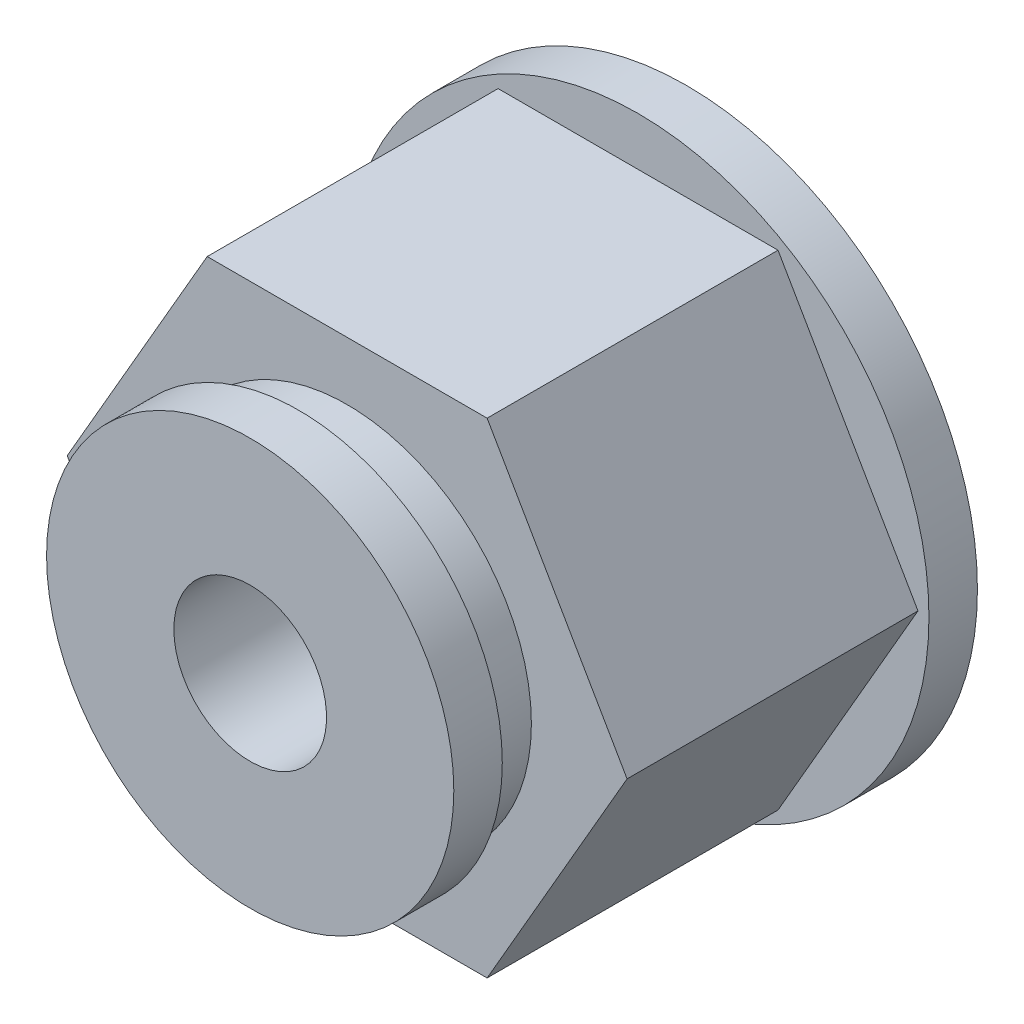
ISO-10303-21;
HEADER;
FILE_DESCRIPTION(('STEP AP214'),'2;1');
FILE_NAME('part.step','',(''),(''),'','','');
FILE_SCHEMA(('AUTOMOTIVE_DESIGN { 1 0 10303 214 1 1 1 1 }'));
ENDSEC;
DATA;
#1=APPLICATION_CONTEXT('core data for automotive mechanical design processes');
#2=APPLICATION_PROTOCOL_DEFINITION('international standard','automotive_design',2000,#1);
#3=PRODUCT_CONTEXT('',#1,'mechanical');
#4=PRODUCT('Part','Part','',(#3));
#5=PRODUCT_RELATED_PRODUCT_CATEGORY('part','',(#4));
#6=PRODUCT_DEFINITION_FORMATION('','',#4);
#7=PRODUCT_DEFINITION_CONTEXT('part definition',#1,'design');
#8=PRODUCT_DEFINITION('design','',#6,#7);
#9=PRODUCT_DEFINITION_SHAPE('','',#8);
#10=(LENGTH_UNIT() NAMED_UNIT(*) SI_UNIT(.MILLI.,.METRE.));
#11=(NAMED_UNIT(*) PLANE_ANGLE_UNIT() SI_UNIT($,.RADIAN.));
#12=(NAMED_UNIT(*) SI_UNIT($,.STERADIAN.) SOLID_ANGLE_UNIT());
#13=UNCERTAINTY_MEASURE_WITH_UNIT(LENGTH_MEASURE(1.E-05),#10,'distance_accuracy_value','');
#14=(GEOMETRIC_REPRESENTATION_CONTEXT(3) GLOBAL_UNCERTAINTY_ASSIGNED_CONTEXT((#13)) GLOBAL_UNIT_ASSIGNED_CONTEXT((#10,
#11,#12)) REPRESENTATION_CONTEXT('',''));
#15=CARTESIAN_POINT('',(0.,0.,0.));
#16=DIRECTION('',(0.,0.,1.));
#17=DIRECTION('',(1.,0.,0.));
#18=AXIS2_PLACEMENT_3D('',#15,#16,#17);
#19=CARTESIAN_POINT('',(3.6661742093542,-6.34999999999996,3.81));
#20=DIRECTION('',(-0.866025403784442,0.499999999999995,0.));
#21=DIRECTION('',(-0.499999999999995,-0.866025403784442,0.));
#22=AXIS2_PLACEMENT_3D('',#19,#20,#21);
#23=PLANE('',#22);
#24=DIRECTION('',(0.499999999999995,0.866025403784441,0.));
#25=VECTOR('',#24,1.);
#26=CARTESIAN_POINT('',(3.6661742093542,-6.34999999999996,-3.81));
#27=LINE('',#26,#25);
#28=CARTESIAN_POINT('',(3.6661742093542,-6.34999999999996,-3.81));
#29=VERTEX_POINT('',#28);
#30=CARTESIAN_POINT('',(7.33234841870825,0.,-3.81));
#31=VERTEX_POINT('',#30);
#32=EDGE_CURVE('E86',#29,#31,#27,.T.);
#33=ORIENTED_EDGE('',*,*,#32,.T.);
#34=DIRECTION('',(0.,0.,-1.));
#35=VECTOR('',#34,1.);
#36=CARTESIAN_POINT('',(7.33234841870825,0.,3.81));
#37=LINE('',#36,#35);
#38=CARTESIAN_POINT('',(7.33234841870825,0.,3.81));
#39=VERTEX_POINT('',#38);
#40=EDGE_CURVE('E11',#39,#31,#37,.T.);
#41=ORIENTED_EDGE('',*,*,#40,.F.);
#42=DIRECTION('',(0.499999999999995,0.866025403784441,0.));
#43=VECTOR('',#42,1.);
#44=CARTESIAN_POINT('',(3.6661742093542,-6.34999999999996,3.81));
#45=LINE('',#44,#43);
#46=CARTESIAN_POINT('',(3.6661742093542,-6.34999999999996,3.81));
#47=VERTEX_POINT('',#46);
#48=EDGE_CURVE('E90',#47,#39,#45,.T.);
#49=ORIENTED_EDGE('',*,*,#48,.F.);
#50=DIRECTION('',(0.,0.,-1.));
#51=VECTOR('',#50,1.);
#52=CARTESIAN_POINT('',(3.6661742093542,-6.34999999999996,3.81));
#53=LINE('',#52,#51);
#54=EDGE_CURVE('E103',#47,#29,#53,.T.);
#55=ORIENTED_EDGE('',*,*,#54,.T.);
#56=EDGE_LOOP('',(#33,#41,#49,#55));
#57=FACE_BOUND('',#56,.T.);
#58=ADVANCED_FACE('F32',(#57),#23,.F.);
#59=CARTESIAN_POINT('',(7.33234841870825,0.,3.81));
#60=DIRECTION('',(-0.866025403784438,-0.500000000000001,0.));
#61=DIRECTION('',(0.500000000000001,-0.866025403784438,0.));
#62=AXIS2_PLACEMENT_3D('',#59,#60,#61);
#63=PLANE('',#62);
#64=DIRECTION('',(-0.500000000000001,0.866025403784438,0.));
#65=VECTOR('',#64,1.);
#66=CARTESIAN_POINT('',(7.33234841870825,0.,-3.81));
#67=LINE('',#66,#65);
#68=CARTESIAN_POINT('',(3.66617420935411,6.35000000000001,-3.81));
#69=VERTEX_POINT('',#68);
#70=EDGE_CURVE('E123',#31,#69,#67,.T.);
#71=ORIENTED_EDGE('',*,*,#70,.T.);
#72=DIRECTION('',(0.,0.,-1.));
#73=VECTOR('',#72,1.);
#74=CARTESIAN_POINT('',(3.66617420935411,6.35000000000001,3.81));
#75=LINE('',#74,#73);
#76=CARTESIAN_POINT('',(3.66617420935411,6.35000000000001,3.81));
#77=VERTEX_POINT('',#76);
#78=EDGE_CURVE('E40',#77,#69,#75,.T.);
#79=ORIENTED_EDGE('',*,*,#78,.F.);
#80=DIRECTION('',(-0.500000000000001,0.866025403784438,0.));
#81=VECTOR('',#80,1.);
#82=CARTESIAN_POINT('',(7.33234841870825,0.,3.81));
#83=LINE('',#82,#81);
#84=EDGE_CURVE('E122',#39,#77,#83,.T.);
#85=ORIENTED_EDGE('',*,*,#84,.F.);
#86=ORIENTED_EDGE('',*,*,#40,.T.);
#87=EDGE_LOOP('',(#71,#79,#85,#86));
#88=FACE_BOUND('',#87,.T.);
#89=ADVANCED_FACE('F121',(#88),#63,.F.);
#90=CARTESIAN_POINT('',(3.66617420935411,6.35000000000001,3.81));
#91=DIRECTION('',(0.,-1.,0.));
#92=DIRECTION('',(1.,0.,0.));
#93=AXIS2_PLACEMENT_3D('',#90,#91,#92);
#94=PLANE('',#93);
#95=DIRECTION('',(-1.,0.,0.));
#96=VECTOR('',#95,1.);
#97=CARTESIAN_POINT('',(3.66617420935411,6.35000000000001,-3.81));
#98=LINE('',#97,#96);
#99=CARTESIAN_POINT('',(-3.66617420935416,6.34999999999999,-3.81));
#100=VERTEX_POINT('',#99);
#101=EDGE_CURVE('E117',#69,#100,#98,.T.);
#102=ORIENTED_EDGE('',*,*,#101,.T.);
#103=DIRECTION('',(0.,0.,-1.));
#104=VECTOR('',#103,1.);
#105=CARTESIAN_POINT('',(-3.66617420935416,6.34999999999999,3.81));
#106=LINE('',#105,#104);
#107=CARTESIAN_POINT('',(-3.66617420935416,6.34999999999999,3.81));
#108=VERTEX_POINT('',#107);
#109=EDGE_CURVE('E105',#108,#100,#106,.T.);
#110=ORIENTED_EDGE('',*,*,#109,.F.);
#111=DIRECTION('',(-1.,0.,0.));
#112=VECTOR('',#111,1.);
#113=CARTESIAN_POINT('',(3.66617420935411,6.35000000000001,3.81));
#114=LINE('',#113,#112);
#115=EDGE_CURVE('E118',#77,#108,#114,.T.);
#116=ORIENTED_EDGE('',*,*,#115,.F.);
#117=ORIENTED_EDGE('',*,*,#78,.T.);
#118=EDGE_LOOP('',(#102,#110,#116,#117));
#119=FACE_BOUND('',#118,.T.);
#120=ADVANCED_FACE('F115',(#119),#94,.F.);
#121=CARTESIAN_POINT('',(-3.66617420935416,6.34999999999999,3.81));
#122=DIRECTION('',(0.866025403784442,-0.499999999999995,0.));
#123=DIRECTION('',(0.499999999999995,0.866025403784442,0.));
#124=AXIS2_PLACEMENT_3D('',#121,#122,#123);
#125=PLANE('',#124);
#126=DIRECTION('',(-0.499999999999995,-0.866025403784441,0.));
#127=VECTOR('',#126,1.);
#128=CARTESIAN_POINT('',(-3.66617420935416,6.34999999999999,-3.81));
#129=LINE('',#128,#127);
#130=CARTESIAN_POINT('',(-7.33234841870825,0.,-3.81));
#131=VERTEX_POINT('',#130);
#132=EDGE_CURVE('E100',#100,#131,#129,.T.);
#133=ORIENTED_EDGE('',*,*,#132,.T.);
#134=DIRECTION('',(0.,0.,-1.));
#135=VECTOR('',#134,1.);
#136=CARTESIAN_POINT('',(-7.33234841870825,0.,3.81));
#137=LINE('',#136,#135);
#138=CARTESIAN_POINT('',(-7.33234841870825,0.,3.81));
#139=VERTEX_POINT('',#138);
#140=EDGE_CURVE('E99',#139,#131,#137,.T.);
#141=ORIENTED_EDGE('',*,*,#140,.F.);
#142=DIRECTION('',(-0.499999999999995,-0.866025403784441,0.));
#143=VECTOR('',#142,1.);
#144=CARTESIAN_POINT('',(-3.66617420935416,6.34999999999999,3.81));
#145=LINE('',#144,#143);
#146=EDGE_CURVE('E134',#108,#139,#145,.T.);
#147=ORIENTED_EDGE('',*,*,#146,.F.);
#148=ORIENTED_EDGE('',*,*,#109,.T.);
#149=EDGE_LOOP('',(#133,#141,#147,#148));
#150=FACE_BOUND('',#149,.T.);
#151=ADVANCED_FACE('F132',(#150),#125,.F.);
#152=CARTESIAN_POINT('',(-7.33234841870825,0.,3.81));
#153=DIRECTION('',(0.866025403784434,0.500000000000007,0.));
#154=DIRECTION('',(-0.500000000000007,0.866025403784435,0.));
#155=AXIS2_PLACEMENT_3D('',#152,#153,#154);
#156=PLANE('',#155);
#157=DIRECTION('',(0.500000000000007,-0.866025403784435,0.));
#158=VECTOR('',#157,1.);
#159=CARTESIAN_POINT('',(-7.33234841870825,0.,-3.81));
#160=LINE('',#159,#158);
#161=CARTESIAN_POINT('',(-3.66617420935407,-6.35000000000004,-3.81));
#162=VERTEX_POINT('',#161);
#163=EDGE_CURVE('E83',#131,#162,#160,.T.);
#164=ORIENTED_EDGE('',*,*,#163,.T.);
#165=DIRECTION('',(0.,0.,-1.));
#166=VECTOR('',#165,1.);
#167=CARTESIAN_POINT('',(-3.66617420935407,-6.35000000000004,3.81));
#168=LINE('',#167,#166);
#169=CARTESIAN_POINT('',(-3.66617420935407,-6.35000000000004,3.81));
#170=VERTEX_POINT('',#169);
#171=EDGE_CURVE('E97',#170,#162,#168,.T.);
#172=ORIENTED_EDGE('',*,*,#171,.F.);
#173=DIRECTION('',(0.500000000000007,-0.866025403784435,0.));
#174=VECTOR('',#173,1.);
#175=CARTESIAN_POINT('',(-7.33234841870825,0.,3.81));
#176=LINE('',#175,#174);
#177=EDGE_CURVE('E135',#139,#170,#176,.T.);
#178=ORIENTED_EDGE('',*,*,#177,.F.);
#179=ORIENTED_EDGE('',*,*,#140,.T.);
#180=EDGE_LOOP('',(#164,#172,#178,#179));
#181=FACE_BOUND('',#180,.T.);
#182=ADVANCED_FACE('F95',(#181),#156,.F.);
#183=CARTESIAN_POINT('',(-3.66617420935407,-6.35000000000004,3.81));
#184=DIRECTION('',(0.,1.,0.));
#185=DIRECTION('',(-1.,0.,0.));
#186=AXIS2_PLACEMENT_3D('',#183,#184,#185);
#187=PLANE('',#186);
#188=DIRECTION('',(1.,0.,0.));
#189=VECTOR('',#188,1.);
#190=CARTESIAN_POINT('',(-3.66617420935407,-6.35000000000004,-3.81));
#191=LINE('',#190,#189);
#192=EDGE_CURVE('E80',#162,#29,#191,.T.);
#193=ORIENTED_EDGE('',*,*,#192,.T.);
#194=ORIENTED_EDGE('',*,*,#54,.F.);
#195=DIRECTION('',(1.,0.,0.));
#196=VECTOR('',#195,1.);
#197=CARTESIAN_POINT('',(-3.66617420935407,-6.35000000000004,3.81));
#198=LINE('',#197,#196);
#199=EDGE_CURVE('E47',#170,#47,#198,.T.);
#200=ORIENTED_EDGE('',*,*,#199,.F.);
#201=ORIENTED_EDGE('',*,*,#171,.T.);
#202=EDGE_LOOP('',(#193,#194,#200,#201));
#203=FACE_BOUND('',#202,.T.);
#204=ADVANCED_FACE('F102',(#203),#187,.F.);
#205=CARTESIAN_POINT('',(0.,0.,3.81));
#206=DIRECTION('',(0.,0.,1.));
#207=DIRECTION('',(1.,0.,0.));
#208=AXIS2_PLACEMENT_3D('',#205,#206,#207);
#209=PLANE('',#208);
#210=CARTESIAN_POINT('',(0.,0.,3.81));
#211=DIRECTION('',(0.,0.,1.));
#212=DIRECTION('',(1.,0.,0.));
#213=AXIS2_PLACEMENT_3D('',#210,#211,#212);
#214=CIRCLE('',#213,4.826);
#215=CARTESIAN_POINT('',(4.826,0.,3.81));
#216=VERTEX_POINT('',#215);
#217=EDGE_CURVE('E148',#216,#216,#214,.T.);
#218=ORIENTED_EDGE('',*,*,#217,.F.);
#219=EDGE_LOOP('',(#218));
#220=FACE_BOUND('',#219,.T.);
#221=ORIENTED_EDGE('',*,*,#48,.T.);
#222=ORIENTED_EDGE('',*,*,#84,.T.);
#223=ORIENTED_EDGE('',*,*,#115,.T.);
#224=ORIENTED_EDGE('',*,*,#146,.T.);
#225=ORIENTED_EDGE('',*,*,#177,.T.);
#226=ORIENTED_EDGE('',*,*,#199,.T.);
#227=EDGE_LOOP('',(#221,#222,#223,#224,#225,#226));
#228=FACE_BOUND('',#227,.T.);
#229=ADVANCED_FACE('F190',(#220,#228),#209,.T.);
#230=CARTESIAN_POINT('',(0.,0.,-3.81));
#231=DIRECTION('',(0.,0.,-1.));
#232=DIRECTION('',(-1.,0.,0.));
#233=AXIS2_PLACEMENT_3D('',#230,#231,#232);
#234=PLANE('',#233);
#235=CARTESIAN_POINT('',(0.,0.,-3.81));
#236=DIRECTION('',(0.,0.,-1.));
#237=DIRECTION('',(-1.,0.,0.));
#238=AXIS2_PLACEMENT_3D('',#235,#236,#237);
#239=CIRCLE('',#238,7.62);
#240=CARTESIAN_POINT('',(-7.62,0.,-3.81));
#241=VERTEX_POINT('',#240);
#242=EDGE_CURVE('E142',#241,#241,#239,.T.);
#243=ORIENTED_EDGE('',*,*,#242,.F.);
#244=EDGE_LOOP('',(#243));
#245=FACE_BOUND('',#244,.T.);
#246=ORIENTED_EDGE('',*,*,#70,.F.);
#247=ORIENTED_EDGE('',*,*,#32,.F.);
#248=ORIENTED_EDGE('',*,*,#192,.F.);
#249=ORIENTED_EDGE('',*,*,#163,.F.);
#250=ORIENTED_EDGE('',*,*,#132,.F.);
#251=ORIENTED_EDGE('',*,*,#101,.F.);
#252=EDGE_LOOP('',(#246,#247,#248,#249,#250,#251));
#253=FACE_BOUND('',#252,.T.);
#254=ADVANCED_FACE('F82',(#245,#253),#234,.F.);
#255=CARTESIAN_POINT('',(0.,0.,-5.08));
#256=DIRECTION('',(0.,0.,1.));
#257=DIRECTION('',(1.,0.,0.));
#258=AXIS2_PLACEMENT_3D('',#255,#256,#257);
#259=CYLINDRICAL_SURFACE('',#258,7.62);
#260=CARTESIAN_POINT('',(0.,0.,-5.08));
#261=DIRECTION('',(0.,0.,-1.));
#262=DIRECTION('',(-1.,0.,0.));
#263=AXIS2_PLACEMENT_3D('',#260,#261,#262);
#264=CIRCLE('',#263,7.62);
#265=CARTESIAN_POINT('',(-7.62,0.,-5.08));
#266=VERTEX_POINT('',#265);
#267=EDGE_CURVE('E127',#266,#266,#264,.T.);
#268=ORIENTED_EDGE('',*,*,#267,.F.);
#269=EDGE_LOOP('',(#268));
#270=FACE_BOUND('',#269,.T.);
#271=ORIENTED_EDGE('',*,*,#242,.T.);
#272=EDGE_LOOP('',(#271));
#273=FACE_BOUND('',#272,.T.);
#274=ADVANCED_FACE('F180',(#270,#273),#259,.T.);
#275=CARTESIAN_POINT('',(0.,0.,-5.08));
#276=DIRECTION('',(0.,0.,-1.));
#277=DIRECTION('',(-1.,0.,0.));
#278=AXIS2_PLACEMENT_3D('',#275,#276,#277);
#279=PLANE('',#278);
#280=CARTESIAN_POINT('',(0.,0.,-5.08));
#281=DIRECTION('',(0.,0.,-1.));
#282=DIRECTION('',(-1.,0.,0.));
#283=AXIS2_PLACEMENT_3D('',#280,#281,#282);
#284=CIRCLE('',#283,2.);
#285=CARTESIAN_POINT('',(-2.,0.,-5.08));
#286=VERTEX_POINT('',#285);
#287=EDGE_CURVE('E160',#286,#286,#284,.T.);
#288=ORIENTED_EDGE('',*,*,#287,.F.);
#289=EDGE_LOOP('',(#288));
#290=FACE_BOUND('',#289,.T.);
#291=ORIENTED_EDGE('',*,*,#267,.T.);
#292=EDGE_LOOP('',(#291));
#293=FACE_BOUND('',#292,.T.);
#294=ADVANCED_FACE('F176',(#290,#293),#279,.T.);
#295=CARTESIAN_POINT('',(0.,0.,5.08));
#296=DIRECTION('',(0.,0.,-1.));
#297=DIRECTION('',(-1.,0.,0.));
#298=AXIS2_PLACEMENT_3D('',#295,#296,#297);
#299=CYLINDRICAL_SURFACE('',#298,4.826);
#300=CARTESIAN_POINT('',(0.,0.,5.08));
#301=DIRECTION('',(0.,0.,1.));
#302=DIRECTION('',(1.,0.,0.));
#303=AXIS2_PLACEMENT_3D('',#300,#301,#302);
#304=CIRCLE('',#303,4.826);
#305=CARTESIAN_POINT('',(4.826,0.,5.08));
#306=VERTEX_POINT('',#305);
#307=EDGE_CURVE('E145',#306,#306,#304,.T.);
#308=ORIENTED_EDGE('',*,*,#307,.F.);
#309=EDGE_LOOP('',(#308));
#310=FACE_BOUND('',#309,.T.);
#311=ORIENTED_EDGE('',*,*,#217,.T.);
#312=EDGE_LOOP('',(#311));
#313=FACE_BOUND('',#312,.T.);
#314=ADVANCED_FACE('F179',(#310,#313),#299,.T.);
#315=CARTESIAN_POINT('',(0.,0.,6.35));
#316=DIRECTION('',(0.,0.,-1.));
#317=DIRECTION('',(-1.,0.,0.));
#318=AXIS2_PLACEMENT_3D('',#315,#316,#317);
#319=CYLINDRICAL_SURFACE('',#318,5.334);
#320=CARTESIAN_POINT('',(0.,0.,6.35));
#321=DIRECTION('',(0.,0.,1.));
#322=DIRECTION('',(1.,0.,0.));
#323=AXIS2_PLACEMENT_3D('',#320,#321,#322);
#324=CIRCLE('',#323,5.334);
#325=CARTESIAN_POINT('',(5.334,0.,6.35));
#326=VERTEX_POINT('',#325);
#327=EDGE_CURVE('E151',#326,#326,#324,.T.);
#328=ORIENTED_EDGE('',*,*,#327,.F.);
#329=EDGE_LOOP('',(#328));
#330=FACE_BOUND('',#329,.T.);
#331=CARTESIAN_POINT('',(0.,0.,5.08));
#332=DIRECTION('',(0.,0.,1.));
#333=DIRECTION('',(1.,0.,0.));
#334=AXIS2_PLACEMENT_3D('',#331,#332,#333);
#335=CIRCLE('',#334,5.334);
#336=CARTESIAN_POINT('',(5.334,0.,5.08));
#337=VERTEX_POINT('',#336);
#338=EDGE_CURVE('E154',#337,#337,#335,.T.);
#339=ORIENTED_EDGE('',*,*,#338,.T.);
#340=EDGE_LOOP('',(#339));
#341=FACE_BOUND('',#340,.T.);
#342=ADVANCED_FACE('F234',(#330,#341),#319,.T.);
#343=CARTESIAN_POINT('',(0.,0.,6.35));
#344=DIRECTION('',(0.,0.,1.));
#345=DIRECTION('',(1.,0.,0.));
#346=AXIS2_PLACEMENT_3D('',#343,#344,#345);
#347=PLANE('',#346);
#348=CARTESIAN_POINT('',(0.,0.,6.35));
#349=DIRECTION('',(0.,0.,-1.));
#350=DIRECTION('',(-1.,0.,0.));
#351=AXIS2_PLACEMENT_3D('',#348,#349,#350);
#352=CIRCLE('',#351,2.);
#353=CARTESIAN_POINT('',(-2.,0.,6.35));
#354=VERTEX_POINT('',#353);
#355=EDGE_CURVE('E157',#354,#354,#352,.T.);
#356=ORIENTED_EDGE('',*,*,#355,.T.);
#357=EDGE_LOOP('',(#356));
#358=FACE_BOUND('',#357,.T.);
#359=ORIENTED_EDGE('',*,*,#327,.T.);
#360=EDGE_LOOP('',(#359));
#361=FACE_BOUND('',#360,.T.);
#362=ADVANCED_FACE('F166',(#358,#361),#347,.T.);
#363=CARTESIAN_POINT('',(0.,0.,5.08));
#364=DIRECTION('',(0.,0.,1.));
#365=DIRECTION('',(1.,0.,0.));
#366=AXIS2_PLACEMENT_3D('',#363,#364,#365);
#367=PLANE('',#366);
#368=ORIENTED_EDGE('',*,*,#307,.T.);
#369=EDGE_LOOP('',(#368));
#370=FACE_BOUND('',#369,.T.);
#371=ORIENTED_EDGE('',*,*,#338,.F.);
#372=EDGE_LOOP('',(#371));
#373=FACE_BOUND('',#372,.T.);
#374=ADVANCED_FACE('F172',(#370,#373),#367,.F.);
#375=CARTESIAN_POINT('',(0.,0.,6.35));
#376=DIRECTION('',(0.,0.,-1.));
#377=DIRECTION('',(-1.,0.,0.));
#378=AXIS2_PLACEMENT_3D('',#375,#376,#377);
#379=CYLINDRICAL_SURFACE('',#378,2.);
#380=ORIENTED_EDGE('',*,*,#355,.F.);
#381=EDGE_LOOP('',(#380));
#382=FACE_BOUND('',#381,.T.);
#383=ORIENTED_EDGE('',*,*,#287,.T.);
#384=EDGE_LOOP('',(#383));
#385=FACE_BOUND('',#384,.T.);
#386=ADVANCED_FACE('F169',(#382,#385),#379,.F.);
#387=CLOSED_SHELL('',(#58,#89,#120,#151,#182,#204,#229,#254,#274,#294,#314,#342,#362,#374,#386));
#388=MANIFOLD_SOLID_BREP('B2',#387);
#389=ADVANCED_BREP_SHAPE_REPRESENTATION('',(#18,#388),#14);
#390=SHAPE_DEFINITION_REPRESENTATION(#9,#389);
ENDSEC;
END-ISO-10303-21;
